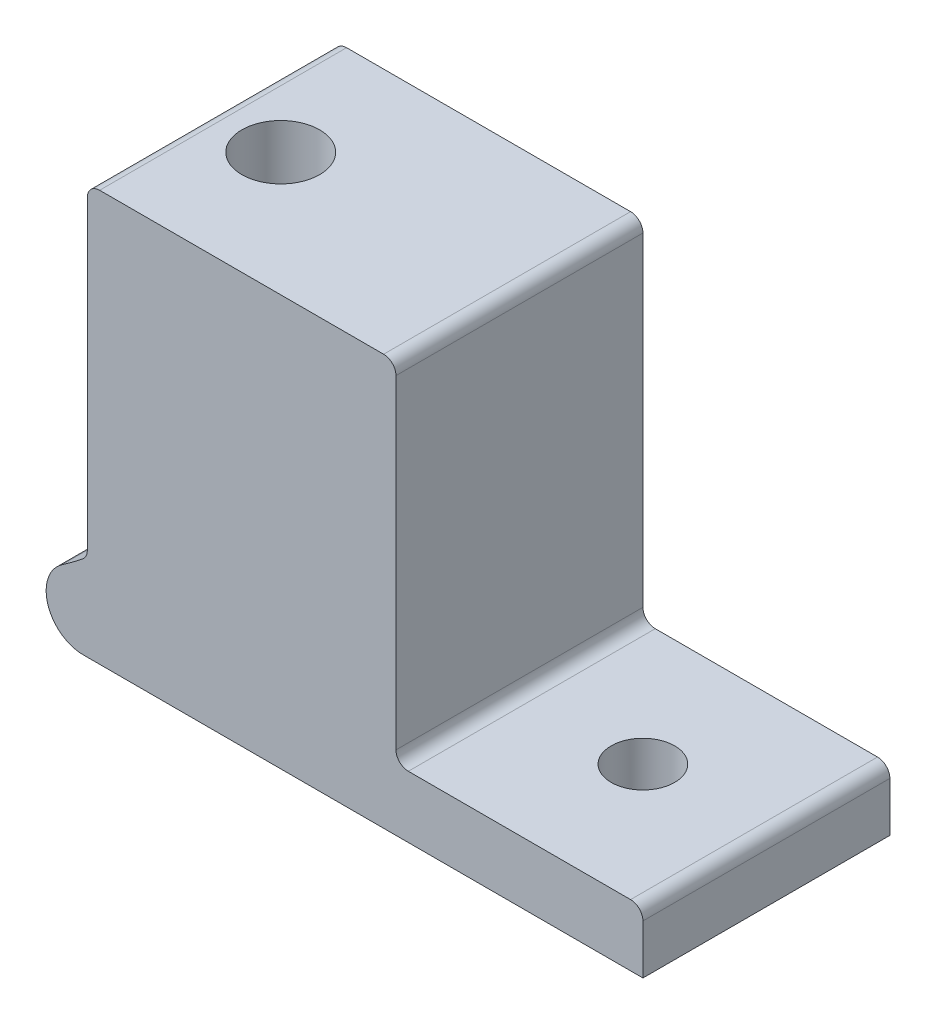
ISO-10303-21;
HEADER;
FILE_DESCRIPTION(('STEP AP214'),'2;1');
FILE_NAME('part.step','',(''),(''),'','','');
FILE_SCHEMA(('AUTOMOTIVE_DESIGN { 1 0 10303 214 1 1 1 1 }'));
ENDSEC;
DATA;
#1=APPLICATION_CONTEXT('core data for automotive mechanical design processes');
#2=APPLICATION_PROTOCOL_DEFINITION('international standard','automotive_design',2000,#1);
#3=PRODUCT_CONTEXT('',#1,'mechanical');
#4=PRODUCT('Part','Part','',(#3));
#5=PRODUCT_RELATED_PRODUCT_CATEGORY('part','',(#4));
#6=PRODUCT_DEFINITION_FORMATION('','',#4);
#7=PRODUCT_DEFINITION_CONTEXT('part definition',#1,'design');
#8=PRODUCT_DEFINITION('design','',#6,#7);
#9=PRODUCT_DEFINITION_SHAPE('','',#8);
#10=(LENGTH_UNIT() NAMED_UNIT(*) SI_UNIT(.MILLI.,.METRE.));
#11=(NAMED_UNIT(*) PLANE_ANGLE_UNIT() SI_UNIT($,.RADIAN.));
#12=(NAMED_UNIT(*) SI_UNIT($,.STERADIAN.) SOLID_ANGLE_UNIT());
#13=UNCERTAINTY_MEASURE_WITH_UNIT(LENGTH_MEASURE(1.E-05),#10,'distance_accuracy_value','');
#14=(GEOMETRIC_REPRESENTATION_CONTEXT(3) GLOBAL_UNCERTAINTY_ASSIGNED_CONTEXT((#13)) GLOBAL_UNIT_ASSIGNED_CONTEXT((#10,
#11,#12)) REPRESENTATION_CONTEXT('',''));
#15=CARTESIAN_POINT('',(0.,0.,0.));
#16=DIRECTION('',(0.,0.,1.));
#17=DIRECTION('',(1.,0.,0.));
#18=AXIS2_PLACEMENT_3D('',#15,#16,#17);
#19=CARTESIAN_POINT('',(0.,0.,12.7));
#20=DIRECTION('',(0.,0.,-1.));
#21=DIRECTION('',(-1.,0.,0.));
#22=AXIS2_PLACEMENT_3D('',#19,#20,#21);
#23=CYLINDRICAL_SURFACE('',#22,38.9999999999999);
#24=CARTESIAN_POINT('',(32.,-22.2934968096077,4.00000000000001));
#25=CARTESIAN_POINT('',(31.8331234852324,-22.5330333355611,3.99999561565649));
#26=CARTESIAN_POINT('',(31.6635558711314,-22.7706840225816,3.98958198545416));
#27=CARTESIAN_POINT('',(31.3200684337904,-23.2408696283417,3.94559163945568));
#28=CARTESIAN_POINT('',(31.1461472387668,-23.4734028901184,3.91200753196114));
#29=CARTESIAN_POINT('',(30.7966355837724,-23.9300954895692,3.81895995582314));
#30=CARTESIAN_POINT('',(30.6210585926834,-24.1542922306732,3.75963261479427));
#31=CARTESIAN_POINT('',(30.2700882068309,-24.5926896437965,3.61159739335414));
#32=CARTESIAN_POINT('',(30.0946948566352,-24.8069024503946,3.52292629939554));
#33=CARTESIAN_POINT('',(29.7626084617116,-25.2041339526433,3.32092946173891));
#34=CARTESIAN_POINT('',(29.6055933370013,-25.388256352554,3.21034083019939));
#35=CARTESIAN_POINT('',(29.2994471967593,-25.7409544753002,2.9574292754624));
#36=CARTESIAN_POINT('',(29.1503125648886,-25.9095373560926,2.81512106753181));
#37=CARTESIAN_POINT('',(28.8891350266257,-26.2001891655891,2.52088448795227));
#38=CARTESIAN_POINT('',(28.7749512642583,-26.3254010510597,2.37401032842275));
#39=CARTESIAN_POINT('',(28.5627667376646,-26.5554659473417,2.05475912698604));
#40=CARTESIAN_POINT('',(28.4647418163483,-26.6603493907313,1.88242089837858));
#41=CARTESIAN_POINT('',(28.3107418389157,-26.8237151431477,1.55391144355306));
#42=CARTESIAN_POINT('',(28.2502590906013,-26.8873289057192,1.4024552633309));
#43=CARTESIAN_POINT('',(28.1728399223758,-26.9683607242981,1.16608268807006));
#44=CARTESIAN_POINT('',(28.1492465561929,-26.9929777890882,1.08573802733644));
#45=CARTESIAN_POINT('',(28.1068979233288,-27.0370713345232,0.922420753107216));
#46=CARTESIAN_POINT('',(28.0881406222463,-27.0565499768432,0.839449261195342));
#47=CARTESIAN_POINT('',(28.0557177327903,-27.0901689362472,0.67086156328984));
#48=CARTESIAN_POINT('',(28.0420864990272,-27.1042732429072,0.585231536100381));
#49=CARTESIAN_POINT('',(28.0203814036598,-27.1267113753442,0.412558123955896));
#50=CARTESIAN_POINT('',(28.0123050489618,-27.1350477898276,0.325515391017926));
#51=CARTESIAN_POINT('',(28.001882511118,-27.1458032718856,0.150719503609792));
#52=CARTESIAN_POINT('',(27.9995360996976,-27.1482225751913,0.0629663775806375));
#53=CARTESIAN_POINT('',(28.000616867332,-27.147107497238,-0.112438053063213));
#54=CARTESIAN_POINT('',(28.0040436153386,-27.143573560473,-0.200089364790828));
#55=CARTESIAN_POINT('',(28.0216876848783,-27.1253636430137,-0.444825611954987));
#56=CARTESIAN_POINT('',(28.0423682770908,-27.1040110045358,-0.601038633682248));
#57=CARTESIAN_POINT('',(28.1009423083963,-27.0432758763674,-0.906419975364352));
#58=CARTESIAN_POINT('',(28.1388372304785,-27.0038918332957,-1.05558768715362));
#59=CARTESIAN_POINT('',(28.231142139416,-26.9073818397128,-1.34916074454141));
#60=CARTESIAN_POINT('',(28.2861030482257,-26.8496622845943,-1.49319511823172));
#61=CARTESIAN_POINT('',(28.4089978305736,-26.7195969632575,-1.76846839636876));
#62=CARTESIAN_POINT('',(28.476938317702,-26.6472437395194,-1.89970072596614));
#63=CARTESIAN_POINT('',(28.6607842593177,-26.4496828011217,-2.21305074611287));
#64=CARTESIAN_POINT('',(28.7832984430327,-26.316517527582,-2.38628749319523));
#65=CARTESIAN_POINT('',(29.0432042509759,-26.0294048218929,-2.70173097014501));
#66=CARTESIAN_POINT('',(29.1806311678749,-25.8754078672634,-2.84386157775276));
#67=CARTESIAN_POINT('',(29.4259024511423,-25.5957242696129,-3.06487418537874));
#68=CARTESIAN_POINT('',(29.5317934852491,-25.4735245563879,-3.15049521753796));
#69=CARTESIAN_POINT('',(29.746436755882,-25.2225445166779,-3.30743714133564));
#70=CARTESIAN_POINT('',(29.8551902839873,-25.0937611940408,-3.37875144806797));
#71=CARTESIAN_POINT('',(30.0742311525285,-24.8308264008898,-3.50822104930676));
#72=CARTESIAN_POINT('',(30.1845197893215,-24.6966701879378,-3.56636440304415));
#73=CARTESIAN_POINT('',(30.4055367017579,-24.4240490090574,-3.6705054496288));
#74=CARTESIAN_POINT('',(30.5162651068742,-24.2855826771278,-3.71649924720499));
#75=CARTESIAN_POINT('',(30.7975713202804,-23.9287599560444,-3.81932548170611));
#76=CARTESIAN_POINT('',(30.9679028485226,-23.707962378115,-3.86841975437551));
#77=CARTESIAN_POINT('',(31.3056233319979,-23.2601963806112,-3.94306462157423));
#78=CARTESIAN_POINT('',(31.4730106384673,-23.033224673998,-3.9686024119455));
#79=CARTESIAN_POINT('',(31.8037736032666,-22.5743248802979,-3.99864046567475));
#80=CARTESIAN_POINT('',(31.9671400323692,-22.3423873292926,-4.00309613910871));
#81=CARTESIAN_POINT('',(32.2885247339905,-21.8753641447709,-3.99281753785568));
#82=CARTESIAN_POINT('',(32.4465437178357,-21.6402789358139,-3.97808582588489));
#83=CARTESIAN_POINT('',(32.8066360824857,-21.0918025316393,-3.92331378911935));
#84=CARTESIAN_POINT('',(33.0064845266695,-20.7776048416269,-3.87664430495575));
#85=CARTESIAN_POINT('',(33.3948214165825,-20.147528866901,-3.75445848689101));
#86=CARTESIAN_POINT('',(33.5833025707148,-19.8316496419876,-3.67892386046869));
#87=CARTESIAN_POINT('',(33.8567690477923,-19.3585243234692,-3.54439075279952));
#88=CARTESIAN_POINT('',(33.946409025608,-19.2008814582685,-3.49598908673134));
#89=CARTESIAN_POINT('',(34.1224874037347,-18.8861942879374,-3.39197736543692));
#90=CARTESIAN_POINT('',(34.2089261640226,-18.7291499172989,-3.33636812388622));
#91=CARTESIAN_POINT('',(34.3784085399956,-18.4162066998216,-3.21774206127125));
#92=CARTESIAN_POINT('',(34.4614548102237,-18.2603070387894,-3.15473118747083));
#93=CARTESIAN_POINT('',(34.624047593286,-17.9500969586862,-3.02083885152895));
#94=CARTESIAN_POINT('',(34.703594744365,-17.7957862537531,-2.94995883311281));
#95=CARTESIAN_POINT('',(34.8566037189528,-17.4941389002198,-2.80192813742431));
#96=CARTESIAN_POINT('',(34.9301771595907,-17.3467331169292,-2.72503476640373));
#97=CARTESIAN_POINT('',(35.073550077429,-17.0549844698317,-2.56223856437977));
#98=CARTESIAN_POINT('',(35.143348360812,-16.9106425835863,-2.47633290837743));
#99=CARTESIAN_POINT('',(35.2783103596822,-16.6272461959109,-2.29465226581627));
#100=CARTESIAN_POINT('',(35.3434964049279,-16.4881679894788,-2.19893124604909));
#101=CARTESIAN_POINT('',(35.4688127305216,-16.2168297184321,-1.99540352756164));
#102=CARTESIAN_POINT('',(35.5289484497714,-16.0845623799025,-1.88761012988319));
#103=CARTESIAN_POINT('',(35.6273085329194,-15.8652186661753,-1.68859335887966));
#104=CARTESIAN_POINT('',(35.6670344467006,-15.7756589389949,-1.60087388732926));
#105=CARTESIAN_POINT('',(35.7423084705634,-15.6043624770655,-1.41601815169941));
#106=CARTESIAN_POINT('',(35.7778497108162,-15.5226386459517,-1.31886686786488));
#107=CARTESIAN_POINT('',(35.8436810682844,-15.3700195346358,-1.11264925548068));
#108=CARTESIAN_POINT('',(35.8739042174521,-15.2992635279415,-1.00345576822602));
#109=CARTESIAN_POINT('',(35.9262579816299,-15.1759183104945,-0.773471513801771));
#110=CARTESIAN_POINT('',(35.9484165559271,-15.1232663700455,-0.652722683596371));
#111=CARTESIAN_POINT('',(35.9764397146394,-15.0564491206479,-0.441949547245692));
#112=CARTESIAN_POINT('',(35.9852528451757,-15.0353517034432,-0.354537108079343));
#113=CARTESIAN_POINT('',(35.9970618872016,-15.007057749595,-0.177112750037109));
#114=CARTESIAN_POINT('',(36.0000638605286,-14.9998467275694,-0.0871036394603439));
#115=CARTESIAN_POINT('',(35.9999339538616,-15.0001585179039,0.0930189463202792));
#116=CARTESIAN_POINT('',(35.99679282301,-15.007703551305,0.18313237437775));
#117=CARTESIAN_POINT('',(35.9847009261625,-15.0366729259116,0.360703620690087));
#118=CARTESIAN_POINT('',(35.9757442794672,-15.0581113161564,0.448158656945923));
#119=CARTESIAN_POINT('',(35.9490912505516,-15.1216520573422,0.646265613057406));
#120=CARTESIAN_POINT('',(35.9294999761425,-15.1682069737965,0.755213033619187));
#121=CARTESIAN_POINT('',(35.8836295583801,-15.2764054617157,0.963800414249555));
#122=CARTESIAN_POINT('',(35.8573340611517,-15.3380859152497,1.06341678837833));
#123=CARTESIAN_POINT('',(35.8036813100519,-15.4628713348557,1.24071593808089));
#124=CARTESIAN_POINT('',(35.7769488320657,-15.5246549847933,1.31954289518636));
#125=CARTESIAN_POINT('',(35.7205160575522,-15.6540639493489,1.47115956928917));
#126=CARTESIAN_POINT('',(35.690813428637,-15.7216938491485,1.5439444582032));
#127=CARTESIAN_POINT('',(35.6289440437246,-15.8614059690126,1.68423623055962));
#128=CARTESIAN_POINT('',(35.5967726772869,-15.9334964682616,1.75173273837105));
#129=CARTESIAN_POINT('',(35.5303819637944,-16.0809982594587,1.88195226787881));
#130=CARTESIAN_POINT('',(35.4961618199262,-16.156410840383,1.94467341050564));
#131=CARTESIAN_POINT('',(35.4234053235253,-16.3153466316576,2.07025081881465));
#132=CARTESIAN_POINT('',(35.3847359688728,-16.3990612423068,2.13278646508085));
#133=CARTESIAN_POINT('',(35.3055933685726,-16.5687615273557,2.25349822187993));
#134=CARTESIAN_POINT('',(35.2651197150926,-16.6547477134004,2.31167333873672));
#135=CARTESIAN_POINT('',(35.1411973554905,-16.9154729406536,2.48040659877113));
#136=CARTESIAN_POINT('',(35.0552980961979,-17.0928672223979,2.58508701528598));
#137=CARTESIAN_POINT('',(34.8776940218406,-17.4524163050696,2.78143927706432));
#138=CARTESIAN_POINT('',(34.7859761563079,-17.634581227572,2.87308026937074));
#139=CARTESIAN_POINT('',(34.5974296014117,-18.0016784732674,3.04460022697552));
#140=CARTESIAN_POINT('',(34.5006024776561,-18.1866099364187,3.12448276725752));
#141=CARTESIAN_POINT('',(34.31462641548,-18.534841155914,3.26408647597369));
#142=CARTESIAN_POINT('',(34.2260432320792,-18.6979365376185,3.32507974996146));
#143=CARTESIAN_POINT('',(34.0453576393008,-19.0249454183811,3.43917442883727));
#144=CARTESIAN_POINT('',(33.9532548133543,-19.1888590122707,3.49227489590928));
#145=CARTESIAN_POINT('',(33.6717436813298,-19.681376479901,3.64009562097048));
#146=CARTESIAN_POINT('',(33.4772139311139,-20.0106045925507,3.72327486373805));
#147=CARTESIAN_POINT('',(33.0754123828524,-20.6679884389352,3.85855201842651));
#148=CARTESIAN_POINT('',(32.8681304464118,-20.9961430951405,3.91062483812514));
#149=CARTESIAN_POINT('',(32.4421694437065,-21.6484899618778,3.98134033061521));
#150=CARTESIAN_POINT('',(32.2234982794064,-21.9726847320057,4.00000587196607));
#151=CARTESIAN_POINT('',(32.,-22.2934968096077,4.00000000000001));
#152=B_SPLINE_CURVE_WITH_KNOTS('',3,(#24,#25,#26,#27,#28,#29,#30,#31,#32,#33,#34,#35,#36,#37,
#38,#39,#40,#41,#42,#43,#44,#45,#46,#47,#48,#49,#50,#51,#52,#53,#54,#55,#56,#57,#58,#59,#60,#61,
#62,#63,#64,#65,#66,#67,#68,#69,#70,#71,#72,#73,#74,#75,#76,#77,#78,#79,#80,#81,#82,#83,#84,#85,
#86,#87,#88,#89,#90,#91,#92,#93,#94,#95,#96,#97,#98,#99,#100,#101,#102,#103,#104,#105,#106,#107,
#108,#109,#110,#111,#112,#113,#114,#115,#116,#117,#118,#119,#120,#121,#122,#123,#124,#125,#126,
#127,#128,#129,#130,#131,#132,#133,#134,#135,#136,#137,#138,#139,#140,#141,#142,#143,#144,#145,
#146,#147,#148,#149,#150,#151),.UNSPECIFIED.,.T.,.F.,(4,2,2,2,2,2,2,2,2,2,2,2,2,2,2,2,2,2,2,2,2,
2,2,2,2,2,2,2,2,2,2,2,2,2,2,2,2,2,2,2,2,2,2,2,2,2,2,2,2,2,2,2,2,2,2,2,2,2,2,2,2,2,2,4),(0.,
0.8755380127671,1.7513554633337,2.62259706537347,3.49275055722056,4.28892308088249,
5.08472701210021,5.75506174786586,6.42438507754154,6.94723829715634,7.20880300669068,
7.47025750285047,7.73343428040174,7.996492863974,8.25954096741718,8.52256943145839,
8.99721002601393,9.47189151791273,9.96385082441888,10.4560614747756,11.2033920938203,
11.9525316064623,12.5007165360407,13.0491532007987,13.5980851051321,14.1471927895875,
14.9953392801155,15.8439465106309,16.694347795702,17.5446355106527,18.6691045354758,
19.7942873477454,20.3572368475648,20.9201228503158,21.4825596247431,22.044893380793,
22.5900698526394,23.1354177295169,23.6779134155244,24.2198171667633,24.6138608809755,
25.0085427200083,25.4078854360364,25.8058301662,26.0757599535417,26.3454080148801,
26.6154624500298,26.8857903927268,27.2440234845355,27.603138931719,27.9136769303882,
28.2244607312152,28.535839757513,28.8473406825281,29.1814510626819,29.5156373497826,
30.1844567726314,30.8548332902975,31.5250055670226,32.1108975120206,32.6968590166048,
33.8693290778815,35.0427436479687,36.2153546632507),.UNSPECIFIED.);
#153=CARTESIAN_POINT('',(32.,-22.2934968096077,4.00000000000001));
#154=VERTEX_POINT('',#153);
#155=EDGE_CURVE('E208',#154,#154,#152,.T.);
#156=ORIENTED_EDGE('',*,*,#155,.T.);
#157=EDGE_LOOP('',(#156));
#158=FACE_BOUND('',#157,.T.);
#159=CARTESIAN_POINT('',(0.,0.,-9.5885));
#160=DIRECTION('',(0.,0.,1.));
#161=DIRECTION('',(1.,0.,0.));
#162=AXIS2_PLACEMENT_3D('',#159,#160,#161);
#163=CIRCLE('',#162,38.9999999999999);
#164=CARTESIAN_POINT('',(38.8749996784563,-3.12000000000001,-9.5885));
#165=VERTEX_POINT('',#164);
#166=CARTESIAN_POINT('',(24.3267259696025,-30.482952671942,-9.5885));
#167=VERTEX_POINT('',#166);
#168=EDGE_CURVE('E60',#165,#167,#163,.F.);
#169=ORIENTED_EDGE('',*,*,#168,.T.);
#170=DIRECTION('',(0.,0.,-1.));
#171=VECTOR('',#170,1.);
#172=CARTESIAN_POINT('',(24.3267259696025,-30.482952671942,12.7));
#173=LINE('',#172,#171);
#174=CARTESIAN_POINT('',(24.3267259696025,-30.482952671942,-12.7));
#175=VERTEX_POINT('',#174);
#176=EDGE_CURVE('E393',#167,#175,#173,.T.);
#177=ORIENTED_EDGE('',*,*,#176,.T.);
#178=CARTESIAN_POINT('',(0.,0.,-12.7));
#179=DIRECTION('',(0.,0.,-1.));
#180=DIRECTION('',(-1.,0.,0.));
#181=AXIS2_PLACEMENT_3D('',#178,#179,#180);
#182=CIRCLE('',#181,38.9999999999999);
#183=CARTESIAN_POINT('',(22.2097753749831,-32.0581639803779,-12.7));
#184=VERTEX_POINT('',#183);
#185=EDGE_CURVE('E288',#175,#184,#182,.T.);
#186=ORIENTED_EDGE('',*,*,#185,.T.);
#187=DIRECTION('',(0.,0.,-1.));
#188=VECTOR('',#187,1.);
#189=CARTESIAN_POINT('',(22.2097753749831,-32.0581639803779,12.7));
#190=LINE('',#189,#188);
#191=CARTESIAN_POINT('',(22.2097753749831,-32.0581639803779,12.7));
#192=VERTEX_POINT('',#191);
#193=EDGE_CURVE('E283',#192,#184,#190,.T.);
#194=ORIENTED_EDGE('',*,*,#193,.F.);
#195=CARTESIAN_POINT('',(0.,0.,12.7));
#196=DIRECTION('',(0.,0.,-1.));
#197=DIRECTION('',(-1.,0.,0.));
#198=AXIS2_PLACEMENT_3D('',#195,#196,#197);
#199=CIRCLE('',#198,38.9999999999999);
#200=CARTESIAN_POINT('',(24.3267259696025,-30.482952671942,12.7));
#201=VERTEX_POINT('',#200);
#202=EDGE_CURVE('E322',#201,#192,#199,.T.);
#203=ORIENTED_EDGE('',*,*,#202,.F.);
#204=DIRECTION('',(0.,0.,-1.));
#205=VECTOR('',#204,1.);
#206=CARTESIAN_POINT('',(24.3267259696025,-30.482952671942,12.7));
#207=LINE('',#206,#205);
#208=CARTESIAN_POINT('',(24.3267259696025,-30.482952671942,9.5885));
#209=VERTEX_POINT('',#208);
#210=EDGE_CURVE('E390',#201,#209,#207,.T.);
#211=ORIENTED_EDGE('',*,*,#210,.T.);
#212=CARTESIAN_POINT('',(0.,0.,9.5885));
#213=DIRECTION('',(0.,0.,-1.));
#214=DIRECTION('',(-1.,0.,0.));
#215=AXIS2_PLACEMENT_3D('',#212,#213,#214);
#216=CIRCLE('',#215,38.9999999999999);
#217=CARTESIAN_POINT('',(38.8749996784563,-3.12000000000001,9.5885));
#218=VERTEX_POINT('',#217);
#219=EDGE_CURVE('E67',#209,#218,#216,.F.);
#220=ORIENTED_EDGE('',*,*,#219,.T.);
#221=DIRECTION('',(0.,0.,-1.));
#222=VECTOR('',#221,1.);
#223=CARTESIAN_POINT('',(38.8749996784563,-3.12000000000001,12.7));
#224=LINE('',#223,#222);
#225=EDGE_CURVE('E179',#218,#165,#224,.T.);
#226=ORIENTED_EDGE('',*,*,#225,.T.);
#227=EDGE_LOOP('',(#169,#177,#186,#194,#203,#211,#220,#226));
#228=FACE_BOUND('',#227,.T.);
#229=ADVANCED_FACE('F44',(#158,#228),#23,.F.);
#230=CARTESIAN_POINT('',(24.3794995846929,-35.1899999999994,12.7));
#231=DIRECTION('',(0.,0.,-1.));
#232=DIRECTION('',(-1.,0.,0.));
#233=AXIS2_PLACEMENT_3D('',#230,#231,#232);
#234=CYLINDRICAL_SURFACE('',#233,3.81000000000001);
#235=CARTESIAN_POINT('',(24.3794995846929,-35.1899999999994,-12.7));
#236=DIRECTION('',(0.,0.,1.));
#237=DIRECTION('',(1.,0.,0.));
#238=AXIS2_PLACEMENT_3D('',#235,#236,#237);
#239=CIRCLE('',#238,3.81000000000001);
#240=CARTESIAN_POINT('',(24.3794995846929,-38.9999999999994,-12.7));
#241=VERTEX_POINT('',#240);
#242=EDGE_CURVE('E277',#184,#241,#239,.T.);
#243=ORIENTED_EDGE('',*,*,#242,.T.);
#244=DIRECTION('',(0.,0.,-1.));
#245=VECTOR('',#244,1.);
#246=CARTESIAN_POINT('',(24.3794995846929,-38.9999999999994,12.7));
#247=LINE('',#246,#245);
#248=CARTESIAN_POINT('',(24.3794995846929,-38.9999999999994,12.7));
#249=VERTEX_POINT('',#248);
#250=EDGE_CURVE('E280',#249,#241,#247,.T.);
#251=ORIENTED_EDGE('',*,*,#250,.F.);
#252=CARTESIAN_POINT('',(24.3794995846929,-35.1899999999994,12.7));
#253=DIRECTION('',(0.,0.,1.));
#254=DIRECTION('',(1.,0.,0.));
#255=AXIS2_PLACEMENT_3D('',#252,#253,#254);
#256=CIRCLE('',#255,3.81000000000001);
#257=EDGE_CURVE('E414',#192,#249,#256,.T.);
#258=ORIENTED_EDGE('',*,*,#257,.F.);
#259=ORIENTED_EDGE('',*,*,#193,.T.);
#260=EDGE_LOOP('',(#243,#251,#258,#259));
#261=FACE_BOUND('',#260,.T.);
#262=ADVANCED_FACE('F266',(#261),#234,.T.);
#263=CARTESIAN_POINT('',(24.3794995846929,-38.9999999999994,12.7));
#264=DIRECTION('',(0.,1.,0.));
#265=DIRECTION('',(-1.,0.,0.));
#266=AXIS2_PLACEMENT_3D('',#263,#264,#265);
#267=PLANE('',#266);
#268=DIRECTION('',(0.,0.,-1.));
#269=VECTOR('',#268,1.);
#270=CARTESIAN_POINT('',(81.9545479700796,-38.9999999999997,12.7));
#271=LINE('',#270,#269);
#272=CARTESIAN_POINT('',(81.9545479700796,-38.9999999999997,12.7));
#273=VERTEX_POINT('',#272);
#274=CARTESIAN_POINT('',(81.9545479700796,-38.9999999999997,-12.7));
#275=VERTEX_POINT('',#274);
#276=EDGE_CURVE('E178',#273,#275,#271,.T.);
#277=ORIENTED_EDGE('',*,*,#276,.F.);
#278=DIRECTION('',(1.,0.,0.));
#279=VECTOR('',#278,1.);
#280=CARTESIAN_POINT('',(24.3794995846929,-38.9999999999994,12.7));
#281=LINE('',#280,#279);
#282=EDGE_CURVE('E293',#249,#273,#281,.T.);
#283=ORIENTED_EDGE('',*,*,#282,.F.);
#284=ORIENTED_EDGE('',*,*,#250,.T.);
#285=DIRECTION('',(1.,0.,0.));
#286=VECTOR('',#285,1.);
#287=CARTESIAN_POINT('',(24.3794995846929,-38.9999999999994,-12.7));
#288=LINE('',#287,#286);
#289=EDGE_CURVE('E287',#241,#275,#288,.T.);
#290=ORIENTED_EDGE('',*,*,#289,.T.);
#291=EDGE_LOOP('',(#277,#283,#284,#290));
#292=FACE_BOUND('',#291,.T.);
#293=CARTESIAN_POINT('',(69.2545479700795,-38.9999999999997,0.));
#294=DIRECTION('',(0.,1.,0.));
#295=DIRECTION('',(0.,0.,1.));
#296=AXIS2_PLACEMENT_3D('',#293,#294,#295);
#297=CIRCLE('',#296,3.26389999999999);
#298=CARTESIAN_POINT('',(69.2545479700795,-38.9999999999997,3.26389999999999));
#299=VERTEX_POINT('',#298);
#300=EDGE_CURVE('E217',#299,#299,#297,.T.);
#301=ORIENTED_EDGE('',*,*,#300,.T.);
#302=EDGE_LOOP('',(#301));
#303=FACE_BOUND('',#302,.T.);
#304=ADVANCED_FACE('F263',(#292,#303),#267,.F.);
#305=CARTESIAN_POINT('',(81.9545479700796,-38.9999999999997,12.7));
#306=DIRECTION('',(-1.,0.,0.));
#307=DIRECTION('',(0.,0.,1.));
#308=AXIS2_PLACEMENT_3D('',#305,#306,#307);
#309=PLANE('',#308);
#310=DIRECTION('',(0.,1.,0.));
#311=VECTOR('',#310,1.);
#312=CARTESIAN_POINT('',(81.9545479700796,-38.9999999999997,-12.7));
#313=LINE('',#312,#311);
#314=CARTESIAN_POINT('',(81.9545479700796,-33.9199999999994,-12.7));
#315=VERTEX_POINT('',#314);
#316=EDGE_CURVE('E299',#275,#315,#313,.T.);
#317=ORIENTED_EDGE('',*,*,#316,.T.);
#318=DIRECTION('',(0.,0.,-1.));
#319=VECTOR('',#318,1.);
#320=CARTESIAN_POINT('',(81.9545479700796,-33.9199999999994,12.7));
#321=LINE('',#320,#319);
#322=CARTESIAN_POINT('',(81.9545479700796,-33.9199999999994,12.7));
#323=VERTEX_POINT('',#322);
#324=EDGE_CURVE('E354',#315,#323,#321,.F.);
#325=ORIENTED_EDGE('',*,*,#324,.T.);
#326=DIRECTION('',(0.,1.,0.));
#327=VECTOR('',#326,1.);
#328=CARTESIAN_POINT('',(81.9545479700796,-38.9999999999997,12.7));
#329=LINE('',#328,#327);
#330=EDGE_CURVE('E452',#273,#323,#329,.T.);
#331=ORIENTED_EDGE('',*,*,#330,.F.);
#332=ORIENTED_EDGE('',*,*,#276,.T.);
#333=EDGE_LOOP('',(#317,#325,#331,#332));
#334=FACE_BOUND('',#333,.T.);
#335=ADVANCED_FACE('F259',(#334),#309,.F.);
#336=CARTESIAN_POINT('',(81.9545479700796,-32.6499999999994,12.7));
#337=DIRECTION('',(0.,-1.,0.));
#338=DIRECTION('',(0.,0.,-1.));
#339=AXIS2_PLACEMENT_3D('',#336,#337,#338);
#340=PLANE('',#339);
#341=CARTESIAN_POINT('',(69.2545479700795,-32.6499999999994,0.));
#342=DIRECTION('',(0.,-1.,0.));
#343=DIRECTION('',(0.,0.,-1.));
#344=AXIS2_PLACEMENT_3D('',#341,#342,#343);
#345=CIRCLE('',#344,3.26389999999999);
#346=CARTESIAN_POINT('',(69.2545479700795,-32.6499999999994,-3.26389999999999));
#347=VERTEX_POINT('',#346);
#348=EDGE_CURVE('E330',#347,#347,#345,.T.);
#349=ORIENTED_EDGE('',*,*,#348,.T.);
#350=EDGE_LOOP('',(#349));
#351=FACE_BOUND('',#350,.T.);
#352=DIRECTION('',(-1.,0.,0.));
#353=VECTOR('',#352,1.);
#354=CARTESIAN_POINT('',(81.9545479700796,-32.6499999999994,12.7));
#355=LINE('',#354,#353);
#356=CARTESIAN_POINT('',(80.6845479700796,-32.6499999999994,12.7));
#357=VERTEX_POINT('',#356);
#358=CARTESIAN_POINT('',(57.8245479700793,-32.6499999999994,12.7));
#359=VERTEX_POINT('',#358);
#360=EDGE_CURVE('E446',#357,#359,#355,.T.);
#361=ORIENTED_EDGE('',*,*,#360,.F.);
#362=DIRECTION('',(0.,0.,-1.));
#363=VECTOR('',#362,1.);
#364=CARTESIAN_POINT('',(80.6845479700796,-32.6499999999994,12.7));
#365=LINE('',#364,#363);
#366=CARTESIAN_POINT('',(80.6845479700796,-32.6499999999994,-12.7));
#367=VERTEX_POINT('',#366);
#368=EDGE_CURVE('E341',#357,#367,#365,.T.);
#369=ORIENTED_EDGE('',*,*,#368,.T.);
#370=DIRECTION('',(-1.,0.,0.));
#371=VECTOR('',#370,1.);
#372=CARTESIAN_POINT('',(81.9545479700796,-32.6499999999994,-12.7));
#373=LINE('',#372,#371);
#374=CARTESIAN_POINT('',(57.8245479700793,-32.6499999999994,-12.7));
#375=VERTEX_POINT('',#374);
#376=EDGE_CURVE('E303',#367,#375,#373,.T.);
#377=ORIENTED_EDGE('',*,*,#376,.T.);
#378=DIRECTION('',(0.,0.,-1.));
#379=VECTOR('',#378,1.);
#380=CARTESIAN_POINT('',(57.8245479700793,-32.6499999999994,12.7));
#381=LINE('',#380,#379);
#382=EDGE_CURVE('E185',#375,#359,#381,.F.);
#383=ORIENTED_EDGE('',*,*,#382,.T.);
#384=EDGE_LOOP('',(#361,#369,#377,#383));
#385=FACE_BOUND('',#384,.T.);
#386=ADVANCED_FACE('F255',(#351,#385),#340,.F.);
#387=CARTESIAN_POINT('',(56.5545479700793,-32.6499999999994,12.7));
#388=DIRECTION('',(-1.,0.,0.));
#389=DIRECTION('',(0.,0.,1.));
#390=AXIS2_PLACEMENT_3D('',#387,#388,#389);
#391=PLANE('',#390);
#392=DIRECTION('',(0.,1.,0.));
#393=VECTOR('',#392,1.);
#394=CARTESIAN_POINT('',(56.5545479700793,-32.6499999999994,12.7));
#395=LINE('',#394,#393);
#396=CARTESIAN_POINT('',(56.5545479700793,-31.3799999999994,12.7));
#397=VERTEX_POINT('',#396);
#398=CARTESIAN_POINT('',(56.5545479700793,1.96000000000029,12.7));
#399=VERTEX_POINT('',#398);
#400=EDGE_CURVE('E437',#397,#399,#395,.T.);
#401=ORIENTED_EDGE('',*,*,#400,.F.);
#402=DIRECTION('',(0.,0.,-1.));
#403=VECTOR('',#402,1.);
#404=CARTESIAN_POINT('',(56.5545479700793,-31.3799999999994,-12.7));
#405=LINE('',#404,#403);
#406=CARTESIAN_POINT('',(56.5545479700793,-31.3799999999994,-12.7));
#407=VERTEX_POINT('',#406);
#408=EDGE_CURVE('E369',#397,#407,#405,.T.);
#409=ORIENTED_EDGE('',*,*,#408,.T.);
#410=DIRECTION('',(0.,1.,0.));
#411=VECTOR('',#410,1.);
#412=CARTESIAN_POINT('',(56.5545479700793,-32.6499999999994,-12.7));
#413=LINE('',#412,#411);
#414=CARTESIAN_POINT('',(56.5545479700793,1.96000000000029,-12.7));
#415=VERTEX_POINT('',#414);
#416=EDGE_CURVE('E310',#407,#415,#413,.T.);
#417=ORIENTED_EDGE('',*,*,#416,.T.);
#418=DIRECTION('',(0.,0.,-1.));
#419=VECTOR('',#418,1.);
#420=CARTESIAN_POINT('',(56.5545479700793,1.96000000000029,12.7));
#421=LINE('',#420,#419);
#422=EDGE_CURVE('E366',#415,#399,#421,.F.);
#423=ORIENTED_EDGE('',*,*,#422,.T.);
#424=EDGE_LOOP('',(#401,#409,#417,#423));
#425=FACE_BOUND('',#424,.T.);
#426=ADVANCED_FACE('F251',(#425),#391,.F.);
#427=CARTESIAN_POINT('',(56.5545479700793,3.23000000000029,12.7));
#428=DIRECTION('',(0.,-1.,0.));
#429=DIRECTION('',(0.,0.,-1.));
#430=AXIS2_PLACEMENT_3D('',#427,#428,#429);
#431=PLANE('',#430);
#432=CARTESIAN_POINT('',(32.,3.23000000000029,0.));
#433=DIRECTION('',(0.,1.,0.));
#434=DIRECTION('',(0.,0.,1.));
#435=AXIS2_PLACEMENT_3D('',#432,#433,#434);
#436=CIRCLE('',#435,4.00000000000001);
#437=CARTESIAN_POINT('',(32.,3.23000000000029,4.00000000000001));
#438=VERTEX_POINT('',#437);
#439=EDGE_CURVE('E199',#438,#438,#436,.T.);
#440=ORIENTED_EDGE('',*,*,#439,.F.);
#441=EDGE_LOOP('',(#440));
#442=FACE_BOUND('',#441,.T.);
#443=DIRECTION('',(-1.,0.,0.));
#444=VECTOR('',#443,1.);
#445=CARTESIAN_POINT('',(56.5545479700793,3.23000000000029,12.7));
#446=LINE('',#445,#444);
#447=CARTESIAN_POINT('',(55.2845479700793,3.23000000000029,12.7));
#448=VERTEX_POINT('',#447);
#449=CARTESIAN_POINT('',(26.0745479700796,3.23000000000029,12.7));
#450=VERTEX_POINT('',#449);
#451=EDGE_CURVE('E418',#448,#450,#446,.T.);
#452=ORIENTED_EDGE('',*,*,#451,.F.);
#453=DIRECTION('',(0.,0.,-1.));
#454=VECTOR('',#453,1.);
#455=CARTESIAN_POINT('',(55.2845479700793,3.23000000000029,12.7));
#456=LINE('',#455,#454);
#457=CARTESIAN_POINT('',(55.2845479700793,3.23000000000029,-12.7));
#458=VERTEX_POINT('',#457);
#459=EDGE_CURVE('E376',#448,#458,#456,.T.);
#460=ORIENTED_EDGE('',*,*,#459,.T.);
#461=DIRECTION('',(-1.,0.,0.));
#462=VECTOR('',#461,1.);
#463=CARTESIAN_POINT('',(56.5545479700793,3.23000000000029,-12.7));
#464=LINE('',#463,#462);
#465=CARTESIAN_POINT('',(26.0745479700796,3.23000000000029,-12.7));
#466=VERTEX_POINT('',#465);
#467=EDGE_CURVE('E314',#458,#466,#464,.T.);
#468=ORIENTED_EDGE('',*,*,#467,.T.);
#469=DIRECTION('',(0.,0.,-1.));
#470=VECTOR('',#469,1.);
#471=CARTESIAN_POINT('',(26.0745479700796,3.23000000000029,12.7));
#472=LINE('',#471,#470);
#473=EDGE_CURVE('E373',#466,#450,#472,.F.);
#474=ORIENTED_EDGE('',*,*,#473,.T.);
#475=EDGE_LOOP('',(#452,#460,#468,#474));
#476=FACE_BOUND('',#475,.T.);
#477=ADVANCED_FACE('F248',(#442,#476),#431,.F.);
#478=CARTESIAN_POINT('',(24.8045479700796,3.23000000000029,12.7));
#479=DIRECTION('',(1.,0.,0.));
#480=DIRECTION('',(0.,0.,-1.));
#481=AXIS2_PLACEMENT_3D('',#478,#479,#480);
#482=PLANE('',#481);
#483=DIRECTION('',(0.,-1.,0.));
#484=VECTOR('',#483,1.);
#485=CARTESIAN_POINT('',(24.8045479700796,3.23000000000029,12.7));
#486=LINE('',#485,#484);
#487=CARTESIAN_POINT('',(24.8045479700796,1.96000000000029,12.7));
#488=VERTEX_POINT('',#487);
#489=CARTESIAN_POINT('',(24.8045479700796,-29.4903026746762,12.7));
#490=VERTEX_POINT('',#489);
#491=EDGE_CURVE('E324',#488,#490,#486,.T.);
#492=ORIENTED_EDGE('',*,*,#491,.F.);
#493=DIRECTION('',(0.,0.,-1.));
#494=VECTOR('',#493,1.);
#495=CARTESIAN_POINT('',(24.8045479700796,1.96000000000029,12.7));
#496=LINE('',#495,#494);
#497=CARTESIAN_POINT('',(24.8045479700796,1.96000000000029,-12.7));
#498=VERTEX_POINT('',#497);
#499=EDGE_CURVE('E386',#488,#498,#496,.T.);
#500=ORIENTED_EDGE('',*,*,#499,.T.);
#501=DIRECTION('',(0.,-1.,0.));
#502=VECTOR('',#501,1.);
#503=CARTESIAN_POINT('',(24.8045479700796,3.23000000000029,-12.7));
#504=LINE('',#503,#502);
#505=CARTESIAN_POINT('',(24.8045479700796,-29.4903026746762,-12.7));
#506=VERTEX_POINT('',#505);
#507=EDGE_CURVE('E318',#498,#506,#504,.T.);
#508=ORIENTED_EDGE('',*,*,#507,.T.);
#509=DIRECTION('',(0.,0.,1.));
#510=VECTOR('',#509,1.);
#511=CARTESIAN_POINT('',(24.8045479700796,-29.4903026746762,-9.5885));
#512=LINE('',#511,#510);
#513=CARTESIAN_POINT('',(24.8045479700796,-29.4903026746762,-9.5885));
#514=VERTEX_POINT('',#513);
#515=EDGE_CURVE('E383',#506,#514,#512,.T.);
#516=ORIENTED_EDGE('',*,*,#515,.T.);
#517=DIRECTION('',(0.,1.,0.));
#518=VECTOR('',#517,1.);
#519=CARTESIAN_POINT('',(24.8045479700796,3.23000000000029,-9.5885));
#520=LINE('',#519,#518);
#521=CARTESIAN_POINT('',(24.8045479700796,-3.12000000000001,-9.5885));
#522=VERTEX_POINT('',#521);
#523=EDGE_CURVE('E173',#514,#522,#520,.T.);
#524=ORIENTED_EDGE('',*,*,#523,.T.);
#525=DIRECTION('',(0.,0.,-1.));
#526=VECTOR('',#525,1.);
#527=CARTESIAN_POINT('',(24.8045479700796,-3.12000000000001,12.7));
#528=LINE('',#527,#526);
#529=CARTESIAN_POINT('',(24.8045479700796,-3.12000000000001,9.5885));
#530=VERTEX_POINT('',#529);
#531=EDGE_CURVE('E164',#530,#522,#528,.T.);
#532=ORIENTED_EDGE('',*,*,#531,.F.);
#533=DIRECTION('',(0.,-1.,0.));
#534=VECTOR('',#533,1.);
#535=CARTESIAN_POINT('',(24.8045479700796,3.23000000000029,9.5885));
#536=LINE('',#535,#534);
#537=CARTESIAN_POINT('',(24.8045479700796,-29.4903026746762,9.5885));
#538=VERTEX_POINT('',#537);
#539=EDGE_CURVE('E170',#530,#538,#536,.T.);
#540=ORIENTED_EDGE('',*,*,#539,.T.);
#541=DIRECTION('',(0.,0.,1.));
#542=VECTOR('',#541,1.);
#543=CARTESIAN_POINT('',(24.8045479700796,-29.4903026746762,12.7));
#544=LINE('',#543,#542);
#545=EDGE_CURVE('E380',#538,#490,#544,.T.);
#546=ORIENTED_EDGE('',*,*,#545,.T.);
#547=EDGE_LOOP('',(#492,#500,#508,#516,#524,#532,#540,#546));
#548=FACE_BOUND('',#547,.T.);
#549=ADVANCED_FACE('F167',(#548),#482,.F.);
#550=CARTESIAN_POINT('',(24.8045479700796,-3.12000000000001,12.7));
#551=DIRECTION('',(0.,1.,0.));
#552=DIRECTION('',(0.,0.,1.));
#553=AXIS2_PLACEMENT_3D('',#550,#551,#552);
#554=PLANE('',#553);
#555=CARTESIAN_POINT('',(32.,-3.12000000000001,0.));
#556=DIRECTION('',(0.,1.,0.));
#557=DIRECTION('',(0.,0.,1.));
#558=AXIS2_PLACEMENT_3D('',#555,#556,#557);
#559=CIRCLE('',#558,4.00000000000001);
#560=CARTESIAN_POINT('',(32.,-3.12000000000001,4.00000000000001));
#561=VERTEX_POINT('',#560);
#562=EDGE_CURVE('E204',#561,#561,#559,.T.);
#563=ORIENTED_EDGE('',*,*,#562,.T.);
#564=EDGE_LOOP('',(#563));
#565=FACE_BOUND('',#564,.T.);
#566=ORIENTED_EDGE('',*,*,#225,.F.);
#567=DIRECTION('',(-1.,0.,0.));
#568=VECTOR('',#567,1.);
#569=CARTESIAN_POINT('',(24.8045479700796,-3.12000000000001,9.5885));
#570=LINE('',#569,#568);
#571=EDGE_CURVE('E182',#218,#530,#570,.T.);
#572=ORIENTED_EDGE('',*,*,#571,.T.);
#573=ORIENTED_EDGE('',*,*,#531,.T.);
#574=DIRECTION('',(1.,0.,0.));
#575=VECTOR('',#574,1.);
#576=CARTESIAN_POINT('',(24.8045479700796,-3.12000000000001,-9.5885));
#577=LINE('',#576,#575);
#578=EDGE_CURVE('E186',#522,#165,#577,.T.);
#579=ORIENTED_EDGE('',*,*,#578,.T.);
#580=EDGE_LOOP('',(#566,#572,#573,#579));
#581=FACE_BOUND('',#580,.T.);
#582=ADVANCED_FACE('F183',(#565,#581),#554,.F.);
#583=CARTESIAN_POINT('',(0.,0.,12.7));
#584=DIRECTION('',(0.,0.,-1.));
#585=DIRECTION('',(-1.,0.,0.));
#586=AXIS2_PLACEMENT_3D('',#583,#584,#585);
#587=PLANE('',#586);
#588=ORIENTED_EDGE('',*,*,#330,.T.);
#589=CARTESIAN_POINT('',(80.6845479700796,-33.9199999999994,12.7));
#590=DIRECTION('',(0.,0.,-1.));
#591=DIRECTION('',(-1.,0.,0.));
#592=AXIS2_PLACEMENT_3D('',#589,#590,#591);
#593=CIRCLE('',#592,1.27);
#594=EDGE_CURVE('E363',#323,#357,#593,.F.);
#595=ORIENTED_EDGE('',*,*,#594,.T.);
#596=ORIENTED_EDGE('',*,*,#360,.T.);
#597=CARTESIAN_POINT('',(57.8245479700793,-31.3799999999994,12.7));
#598=DIRECTION('',(0.,0.,-1.));
#599=DIRECTION('',(-1.,0.,0.));
#600=AXIS2_PLACEMENT_3D('',#597,#598,#599);
#601=CIRCLE('',#600,1.27);
#602=EDGE_CURVE('E399',#359,#397,#601,.T.);
#603=ORIENTED_EDGE('',*,*,#602,.T.);
#604=ORIENTED_EDGE('',*,*,#400,.T.);
#605=CARTESIAN_POINT('',(55.2845479700793,1.96000000000029,12.7));
#606=DIRECTION('',(0.,0.,-1.));
#607=DIRECTION('',(-1.,0.,0.));
#608=AXIS2_PLACEMENT_3D('',#605,#606,#607);
#609=CIRCLE('',#608,1.27);
#610=EDGE_CURVE('E360',#399,#448,#609,.F.);
#611=ORIENTED_EDGE('',*,*,#610,.T.);
#612=ORIENTED_EDGE('',*,*,#451,.T.);
#613=CARTESIAN_POINT('',(26.0745479700796,1.96000000000029,12.7));
#614=DIRECTION('',(0.,0.,-1.));
#615=DIRECTION('',(-1.,0.,0.));
#616=AXIS2_PLACEMENT_3D('',#613,#614,#615);
#617=CIRCLE('',#616,1.27);
#618=EDGE_CURVE('E357',#450,#488,#617,.F.);
#619=ORIENTED_EDGE('',*,*,#618,.T.);
#620=ORIENTED_EDGE('',*,*,#491,.T.);
#621=CARTESIAN_POINT('',(23.5345479700796,-29.4903026746762,12.7));
#622=DIRECTION('',(0.,0.,-1.));
#623=DIRECTION('',(-1.,0.,0.));
#624=AXIS2_PLACEMENT_3D('',#621,#622,#623);
#625=CIRCLE('',#624,1.27);
#626=EDGE_CURVE('E53',#490,#201,#625,.T.);
#627=ORIENTED_EDGE('',*,*,#626,.T.);
#628=ORIENTED_EDGE('',*,*,#202,.T.);
#629=ORIENTED_EDGE('',*,*,#257,.T.);
#630=ORIENTED_EDGE('',*,*,#282,.T.);
#631=EDGE_LOOP('',(#588,#595,#596,#603,#604,#611,#612,#619,#620,#627,#628,#629,#630));
#632=FACE_BOUND('',#631,.T.);
#633=ADVANCED_FACE('F236',(#632),#587,.F.);
#634=CARTESIAN_POINT('',(0.,0.,-12.7));
#635=DIRECTION('',(0.,0.,-1.));
#636=DIRECTION('',(-1.,0.,0.));
#637=AXIS2_PLACEMENT_3D('',#634,#635,#636);
#638=PLANE('',#637);
#639=ORIENTED_EDGE('',*,*,#376,.F.);
#640=CARTESIAN_POINT('',(80.6845479700796,-33.9199999999994,-12.7));
#641=DIRECTION('',(0.,0.,-1.));
#642=DIRECTION('',(-1.,0.,0.));
#643=AXIS2_PLACEMENT_3D('',#640,#641,#642);
#644=CIRCLE('',#643,1.27);
#645=EDGE_CURVE('E351',#367,#315,#644,.T.);
#646=ORIENTED_EDGE('',*,*,#645,.T.);
#647=ORIENTED_EDGE('',*,*,#316,.F.);
#648=ORIENTED_EDGE('',*,*,#289,.F.);
#649=ORIENTED_EDGE('',*,*,#242,.F.);
#650=ORIENTED_EDGE('',*,*,#185,.F.);
#651=CARTESIAN_POINT('',(23.5345479700796,-29.4903026746762,-12.7));
#652=DIRECTION('',(0.,0.,-1.));
#653=DIRECTION('',(-1.,0.,0.));
#654=AXIS2_PLACEMENT_3D('',#651,#652,#653);
#655=CIRCLE('',#654,1.27);
#656=EDGE_CURVE('E402',#175,#506,#655,.F.);
#657=ORIENTED_EDGE('',*,*,#656,.T.);
#658=ORIENTED_EDGE('',*,*,#507,.F.);
#659=CARTESIAN_POINT('',(26.0745479700796,1.96000000000029,-12.7));
#660=DIRECTION('',(0.,0.,-1.));
#661=DIRECTION('',(-1.,0.,0.));
#662=AXIS2_PLACEMENT_3D('',#659,#660,#661);
#663=CIRCLE('',#662,1.27);
#664=EDGE_CURVE('E345',#498,#466,#663,.T.);
#665=ORIENTED_EDGE('',*,*,#664,.T.);
#666=ORIENTED_EDGE('',*,*,#467,.F.);
#667=CARTESIAN_POINT('',(55.2845479700793,1.96000000000029,-12.7));
#668=DIRECTION('',(0.,0.,-1.));
#669=DIRECTION('',(-1.,0.,0.));
#670=AXIS2_PLACEMENT_3D('',#667,#668,#669);
#671=CIRCLE('',#670,1.27);
#672=EDGE_CURVE('E348',#458,#415,#671,.T.);
#673=ORIENTED_EDGE('',*,*,#672,.T.);
#674=ORIENTED_EDGE('',*,*,#416,.F.);
#675=CARTESIAN_POINT('',(57.8245479700793,-31.3799999999994,-12.7));
#676=DIRECTION('',(0.,0.,-1.));
#677=DIRECTION('',(-1.,0.,0.));
#678=AXIS2_PLACEMENT_3D('',#675,#676,#677);
#679=CIRCLE('',#678,1.27);
#680=EDGE_CURVE('E396',#407,#375,#679,.F.);
#681=ORIENTED_EDGE('',*,*,#680,.T.);
#682=EDGE_LOOP('',(#639,#646,#647,#648,#649,#650,#657,#658,#665,#666,#673,#674,#681));
#683=FACE_BOUND('',#682,.T.);
#684=ADVANCED_FACE('F234',(#683),#638,.T.);
#685=CARTESIAN_POINT('',(69.2545479700795,-38.9999999999997,0.));
#686=DIRECTION('',(0.,1.,0.));
#687=DIRECTION('',(0.,0.,1.));
#688=AXIS2_PLACEMENT_3D('',#685,#686,#687);
#689=CYLINDRICAL_SURFACE('',#688,3.26389999999999);
#690=ORIENTED_EDGE('',*,*,#300,.F.);
#691=EDGE_LOOP('',(#690));
#692=FACE_BOUND('',#691,.T.);
#693=ORIENTED_EDGE('',*,*,#348,.F.);
#694=EDGE_LOOP('',(#693));
#695=FACE_BOUND('',#694,.T.);
#696=ADVANCED_FACE('F231',(#692,#695),#689,.F.);
#697=CARTESIAN_POINT('',(32.,-28.5199999999997,0.));
#698=DIRECTION('',(0.,1.,0.));
#699=DIRECTION('',(0.,0.,1.));
#700=AXIS2_PLACEMENT_3D('',#697,#698,#699);
#701=CYLINDRICAL_SURFACE('',#700,4.00000000000001);
#702=ORIENTED_EDGE('',*,*,#439,.T.);
#703=EDGE_LOOP('',(#702));
#704=FACE_BOUND('',#703,.T.);
#705=ORIENTED_EDGE('',*,*,#562,.F.);
#706=EDGE_LOOP('',(#705));
#707=FACE_BOUND('',#706,.T.);
#708=ADVANCED_FACE('F228',(#704,#707),#701,.F.);
#709=CARTESIAN_POINT('',(32.,-28.5199999999997,0.));
#710=DIRECTION('',(0.,1.,0.));
#711=DIRECTION('',(0.,0.,1.));
#712=AXIS2_PLACEMENT_3D('',#709,#710,#711);
#713=CIRCLE('',#712,4.00000000000001);
#714=CARTESIAN_POINT('',(32.,-28.5199999999997,4.00000000000001));
#715=VERTEX_POINT('',#714);
#716=EDGE_CURVE('E200',#715,#715,#713,.T.);
#717=ORIENTED_EDGE('',*,*,#716,.F.);
#718=EDGE_LOOP('',(#717));
#719=FACE_BOUND('',#718,.T.);
#720=ORIENTED_EDGE('',*,*,#155,.F.);
#721=EDGE_LOOP('',(#720));
#722=FACE_BOUND('',#721,.T.);
#723=ADVANCED_FACE('F222',(#719,#722),#701,.F.);
#724=CARTESIAN_POINT('',(32.,-28.5199999999997,0.));
#725=DIRECTION('',(0.,1.,0.));
#726=DIRECTION('',(0.,0.,1.));
#727=AXIS2_PLACEMENT_3D('',#724,#725,#726);
#728=PLANE('',#727);
#729=ORIENTED_EDGE('',*,*,#716,.T.);
#730=EDGE_LOOP('',(#729));
#731=FACE_BOUND('',#730,.T.);
#732=ADVANCED_FACE('F227',(#731),#728,.T.);
#733=CARTESIAN_POINT('',(98.8990202450997,3.23000000000029,-9.5885));
#734=DIRECTION('',(0.,0.,1.));
#735=DIRECTION('',(1.,0.,0.));
#736=AXIS2_PLACEMENT_3D('',#733,#734,#735);
#737=PLANE('',#736);
#738=ORIENTED_EDGE('',*,*,#168,.F.);
#739=ORIENTED_EDGE('',*,*,#578,.F.);
#740=ORIENTED_EDGE('',*,*,#523,.F.);
#741=CARTESIAN_POINT('',(23.5345479700796,-29.4903026746762,-9.5885));
#742=DIRECTION('',(0.,0.,1.));
#743=DIRECTION('',(1.,0.,0.));
#744=AXIS2_PLACEMENT_3D('',#741,#742,#743);
#745=CIRCLE('',#744,1.27);
#746=EDGE_CURVE('E405',#514,#167,#745,.F.);
#747=ORIENTED_EDGE('',*,*,#746,.T.);
#748=EDGE_LOOP('',(#738,#739,#740,#747));
#749=FACE_BOUND('',#748,.T.);
#750=ADVANCED_FACE('F471',(#749),#737,.T.);
#751=CARTESIAN_POINT('',(98.8990202450997,3.23000000000029,9.5885));
#752=DIRECTION('',(0.,0.,-1.));
#753=DIRECTION('',(-1.,0.,0.));
#754=AXIS2_PLACEMENT_3D('',#751,#752,#753);
#755=PLANE('',#754);
#756=ORIENTED_EDGE('',*,*,#219,.F.);
#757=CARTESIAN_POINT('',(23.5345479700796,-29.4903026746762,9.5885));
#758=DIRECTION('',(0.,0.,-1.));
#759=DIRECTION('',(-1.,0.,0.));
#760=AXIS2_PLACEMENT_3D('',#757,#758,#759);
#761=CIRCLE('',#760,1.27);
#762=EDGE_CURVE('E11',#209,#538,#761,.F.);
#763=ORIENTED_EDGE('',*,*,#762,.T.);
#764=ORIENTED_EDGE('',*,*,#539,.F.);
#765=ORIENTED_EDGE('',*,*,#571,.F.);
#766=EDGE_LOOP('',(#756,#763,#764,#765));
#767=FACE_BOUND('',#766,.T.);
#768=ADVANCED_FACE('F188',(#767),#755,.T.);
#769=CARTESIAN_POINT('',(80.6845479700796,-33.9199999999994,12.7));
#770=DIRECTION('',(0.,0.,-1.));
#771=DIRECTION('',(-1.,0.,0.));
#772=AXIS2_PLACEMENT_3D('',#769,#770,#771);
#773=CYLINDRICAL_SURFACE('',#772,1.27);
#774=ORIENTED_EDGE('',*,*,#594,.F.);
#775=ORIENTED_EDGE('',*,*,#324,.F.);
#776=ORIENTED_EDGE('',*,*,#645,.F.);
#777=ORIENTED_EDGE('',*,*,#368,.F.);
#778=EDGE_LOOP('',(#774,#775,#776,#777));
#779=FACE_BOUND('',#778,.T.);
#780=ADVANCED_FACE('F449',(#779),#773,.T.);
#781=CARTESIAN_POINT('',(57.8245479700793,-31.3799999999994,12.7));
#782=DIRECTION('',(0.,0.,1.));
#783=DIRECTION('',(1.,0.,0.));
#784=AXIS2_PLACEMENT_3D('',#781,#782,#783);
#785=CYLINDRICAL_SURFACE('',#784,1.27);
#786=ORIENTED_EDGE('',*,*,#602,.F.);
#787=ORIENTED_EDGE('',*,*,#382,.F.);
#788=ORIENTED_EDGE('',*,*,#680,.F.);
#789=ORIENTED_EDGE('',*,*,#408,.F.);
#790=EDGE_LOOP('',(#786,#787,#788,#789));
#791=FACE_BOUND('',#790,.T.);
#792=ADVANCED_FACE('F440',(#791),#785,.F.);
#793=CARTESIAN_POINT('',(55.2845479700793,1.96000000000029,12.7));
#794=DIRECTION('',(0.,0.,-1.));
#795=DIRECTION('',(-1.,0.,0.));
#796=AXIS2_PLACEMENT_3D('',#793,#794,#795);
#797=CYLINDRICAL_SURFACE('',#796,1.27);
#798=ORIENTED_EDGE('',*,*,#610,.F.);
#799=ORIENTED_EDGE('',*,*,#422,.F.);
#800=ORIENTED_EDGE('',*,*,#672,.F.);
#801=ORIENTED_EDGE('',*,*,#459,.F.);
#802=EDGE_LOOP('',(#798,#799,#800,#801));
#803=FACE_BOUND('',#802,.T.);
#804=ADVANCED_FACE('F431',(#803),#797,.T.);
#805=CARTESIAN_POINT('',(26.0745479700796,1.96000000000029,12.7));
#806=DIRECTION('',(0.,0.,-1.));
#807=DIRECTION('',(-1.,0.,0.));
#808=AXIS2_PLACEMENT_3D('',#805,#806,#807);
#809=CYLINDRICAL_SURFACE('',#808,1.27);
#810=ORIENTED_EDGE('',*,*,#618,.F.);
#811=ORIENTED_EDGE('',*,*,#473,.F.);
#812=ORIENTED_EDGE('',*,*,#664,.F.);
#813=ORIENTED_EDGE('',*,*,#499,.F.);
#814=EDGE_LOOP('',(#810,#811,#812,#813));
#815=FACE_BOUND('',#814,.T.);
#816=ADVANCED_FACE('F422',(#815),#809,.T.);
#817=CARTESIAN_POINT('',(23.5345479700796,-29.4903026746762,12.7));
#818=DIRECTION('',(0.,0.,-1.));
#819=DIRECTION('',(-1.,0.,0.));
#820=AXIS2_PLACEMENT_3D('',#817,#818,#819);
#821=CYLINDRICAL_SURFACE('',#820,1.27);
#822=ORIENTED_EDGE('',*,*,#746,.F.);
#823=ORIENTED_EDGE('',*,*,#515,.F.);
#824=ORIENTED_EDGE('',*,*,#656,.F.);
#825=ORIENTED_EDGE('',*,*,#176,.F.);
#826=EDGE_LOOP('',(#822,#823,#824,#825));
#827=FACE_BOUND('',#826,.T.);
#828=ADVANCED_FACE('F469',(#827),#821,.F.);
#829=CARTESIAN_POINT('',(23.5345479700796,-29.4903026746762,12.7));
#830=DIRECTION('',(0.,0.,-1.));
#831=DIRECTION('',(-1.,0.,0.));
#832=AXIS2_PLACEMENT_3D('',#829,#830,#831);
#833=CYLINDRICAL_SURFACE('',#832,1.27);
#834=ORIENTED_EDGE('',*,*,#762,.F.);
#835=ORIENTED_EDGE('',*,*,#210,.F.);
#836=ORIENTED_EDGE('',*,*,#626,.F.);
#837=ORIENTED_EDGE('',*,*,#545,.F.);
#838=EDGE_LOOP('',(#834,#835,#836,#837));
#839=FACE_BOUND('',#838,.T.);
#840=ADVANCED_FACE('F46',(#839),#833,.F.);
#841=CLOSED_SHELL('',(#229,#262,#304,#335,#386,#426,#477,#549,#582,#633,#684,#696,#708,#723,
#732,#750,#768,#780,#792,#804,#816,#828,#840));
#842=MANIFOLD_SOLID_BREP('B2',#841);
#843=ADVANCED_BREP_SHAPE_REPRESENTATION('',(#18,#842),#14);
#844=SHAPE_DEFINITION_REPRESENTATION(#9,#843);
ENDSEC;
END-ISO-10303-21;
